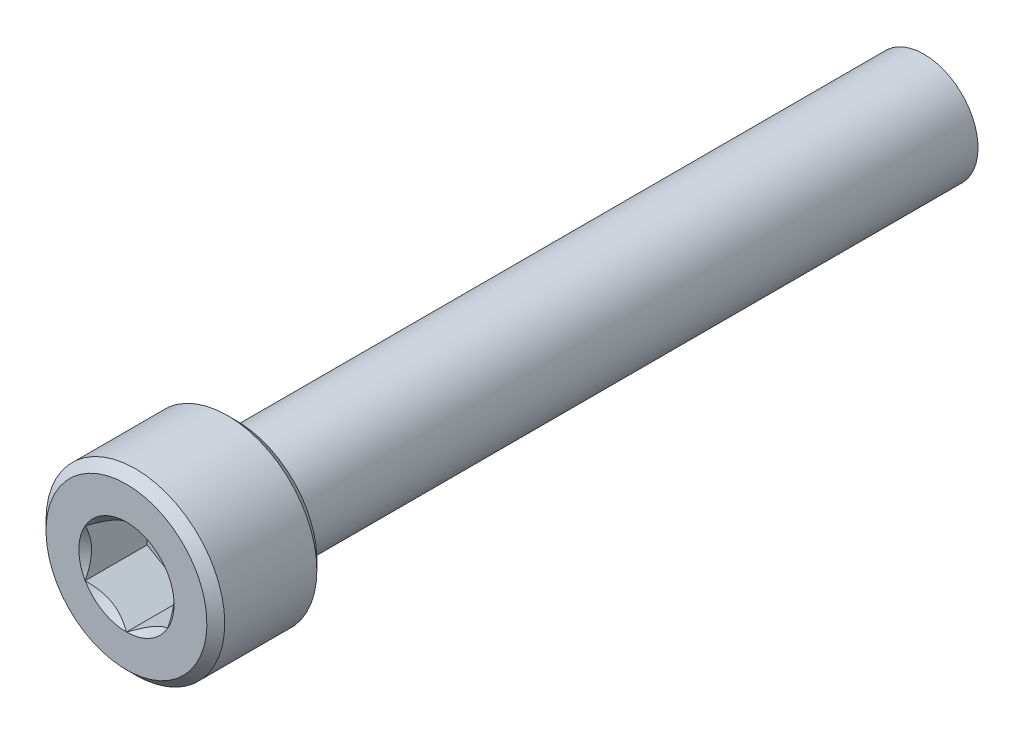
ISO-10303-21;
HEADER;
FILE_DESCRIPTION(('STEP AP214'),'2;1');
FILE_NAME('part.step','',(''),(''),'','','');
FILE_SCHEMA(('AUTOMOTIVE_DESIGN { 1 0 10303 214 1 1 1 1 }'));
ENDSEC;
DATA;
#1=APPLICATION_CONTEXT('core data for automotive mechanical design processes');
#2=APPLICATION_PROTOCOL_DEFINITION('international standard','automotive_design',2000,#1);
#3=PRODUCT_CONTEXT('',#1,'mechanical');
#4=PRODUCT('Part','Part','',(#3));
#5=PRODUCT_RELATED_PRODUCT_CATEGORY('part','',(#4));
#6=PRODUCT_DEFINITION_FORMATION('','',#4);
#7=PRODUCT_DEFINITION_CONTEXT('part definition',#1,'design');
#8=PRODUCT_DEFINITION('design','',#6,#7);
#9=PRODUCT_DEFINITION_SHAPE('','',#8);
#10=(LENGTH_UNIT() NAMED_UNIT(*) SI_UNIT(.MILLI.,.METRE.));
#11=(NAMED_UNIT(*) PLANE_ANGLE_UNIT() SI_UNIT($,.RADIAN.));
#12=(NAMED_UNIT(*) SI_UNIT($,.STERADIAN.) SOLID_ANGLE_UNIT());
#13=UNCERTAINTY_MEASURE_WITH_UNIT(LENGTH_MEASURE(1.E-05),#10,'distance_accuracy_value','');
#14=(GEOMETRIC_REPRESENTATION_CONTEXT(3) GLOBAL_UNCERTAINTY_ASSIGNED_CONTEXT((#13)) GLOBAL_UNIT_ASSIGNED_CONTEXT((#10,
#11,#12)) REPRESENTATION_CONTEXT('',''));
#15=CARTESIAN_POINT('',(0.,0.,0.));
#16=DIRECTION('',(0.,0.,1.));
#17=DIRECTION('',(1.,0.,0.));
#18=AXIS2_PLACEMENT_3D('',#15,#16,#17);
#19=CARTESIAN_POINT('',(3.,-5.19615242270663,3.5));
#20=DIRECTION('',(0.,0.,1.));
#21=DIRECTION('',(0.,-1.,0.));
#22=AXIS2_PLACEMENT_3D('',#19,#20,#21);
#23=PLANE('',#22);
#24=DIRECTION('',(-0.866025403784439,-0.5,0.));
#25=VECTOR('',#24,1.);
#26=CARTESIAN_POINT('',(0.,3.46410161513776,3.5));
#27=LINE('',#26,#25);
#28=CARTESIAN_POINT('',(0.,3.46410161513776,3.5));
#29=VERTEX_POINT('',#28);
#30=CARTESIAN_POINT('',(-3.,1.73205080756888,3.5));
#31=VERTEX_POINT('',#30);
#32=EDGE_CURVE('E82',#29,#31,#27,.T.);
#33=ORIENTED_EDGE('',*,*,#32,.T.);
#34=DIRECTION('',(0.,-1.,0.));
#35=VECTOR('',#34,1.);
#36=CARTESIAN_POINT('',(-3.,1.73205080756888,3.5));
#37=LINE('',#36,#35);
#38=CARTESIAN_POINT('',(-3.,-1.73205080756888,3.5));
#39=VERTEX_POINT('',#38);
#40=EDGE_CURVE('E84',#31,#39,#37,.T.);
#41=ORIENTED_EDGE('',*,*,#40,.T.);
#42=DIRECTION('',(0.866025403784439,-0.5,0.));
#43=VECTOR('',#42,1.);
#44=CARTESIAN_POINT('',(-3.,-1.73205080756888,3.5));
#45=LINE('',#44,#43);
#46=CARTESIAN_POINT('',(0.,-3.46410161513776,3.5));
#47=VERTEX_POINT('',#46);
#48=EDGE_CURVE('E85',#39,#47,#45,.T.);
#49=ORIENTED_EDGE('',*,*,#48,.T.);
#50=DIRECTION('',(0.866025403784439,0.5,0.));
#51=VECTOR('',#50,1.);
#52=CARTESIAN_POINT('',(0.,-3.46410161513776,3.5));
#53=LINE('',#52,#51);
#54=CARTESIAN_POINT('',(3.,-1.73205080756888,3.5));
#55=VERTEX_POINT('',#54);
#56=EDGE_CURVE('E71',#47,#55,#53,.T.);
#57=ORIENTED_EDGE('',*,*,#56,.T.);
#58=DIRECTION('',(0.,1.,0.));
#59=VECTOR('',#58,1.);
#60=CARTESIAN_POINT('',(3.,-1.73205080756888,3.5));
#61=LINE('',#60,#59);
#62=CARTESIAN_POINT('',(3.,1.73205080756888,3.5));
#63=VERTEX_POINT('',#62);
#64=EDGE_CURVE('E110',#55,#63,#61,.T.);
#65=ORIENTED_EDGE('',*,*,#64,.T.);
#66=DIRECTION('',(-0.866025403784439,0.5,0.));
#67=VECTOR('',#66,1.);
#68=CARTESIAN_POINT('',(3.,1.73205080756888,3.5));
#69=LINE('',#68,#67);
#70=EDGE_CURVE('E115',#63,#29,#69,.T.);
#71=ORIENTED_EDGE('',*,*,#70,.T.);
#72=EDGE_LOOP('',(#33,#41,#49,#57,#65,#71));
#73=FACE_BOUND('',#72,.T.);
#74=ADVANCED_FACE('F16',(#73),#23,.T.);
#75=CARTESIAN_POINT('',(-3.,-1.73205080756888,3.5));
#76=DIRECTION('',(-0.5,-0.866025403784439,0.));
#77=DIRECTION('',(0.866025403784439,-0.5,0.));
#78=AXIS2_PLACEMENT_3D('',#75,#76,#77);
#79=PLANE('',#78);
#80=CARTESIAN_POINT('',(-2.99999999999032,-1.7320508075832,8.00000000004136));
#81=CARTESIAN_POINT('',(-2.89688854158698,-1.79158223584331,7.9405256964109));
#82=CARTESIAN_POINT('',(-2.79205304728486,-1.85210903669697,7.88454499927976));
#83=CARTESIAN_POINT('',(-2.57828271602221,-1.97552939499453,7.78204673290586));
#84=CARTESIAN_POINT('',(-2.46932756060096,-2.03843468330721,7.73558617503093));
#85=CARTESIAN_POINT('',(-2.24962485444419,-2.16528009984896,7.65599891925579));
#86=CARTESIAN_POINT('',(-2.13893322488729,-2.2291879419705,7.62267223591901));
#87=CARTESIAN_POINT('',(-1.91511368639457,-2.35841021276905,7.57132616074406));
#88=CARTESIAN_POINT('',(-1.80199261010754,-2.42372069661444,7.55326845527869));
#89=CARTESIAN_POINT('',(-1.60702348021882,-2.53628617623938,7.53697523665388));
#90=CARTESIAN_POINT('',(-1.52542705975241,-2.58339589156056,7.53456399619299));
#91=CARTESIAN_POINT('',(-1.36236704805204,-2.67753863320983,7.53863151806395));
#92=CARTESIAN_POINT('',(-1.28090351339421,-2.72457162687367,7.545113396421));
#93=CARTESIAN_POINT('',(-1.11874833460044,-2.81819196300075,7.56659704587872));
#94=CARTESIAN_POINT('',(-1.03805765621663,-2.86477874788674,7.58160834263353));
#95=CARTESIAN_POINT('',(-0.878062170848356,-2.95715218443323,7.61933151354671));
#96=CARTESIAN_POINT('',(-0.798757258069119,-3.00293889717438,7.64204279713312));
#97=CARTESIAN_POINT('',(-0.657986748130276,-3.08421278898154,7.68876371422157));
#98=CARTESIAN_POINT('',(-0.596209197436678,-3.11988007450436,7.71154386359159));
#99=CARTESIAN_POINT('',(-0.473762853058809,-3.19057450439221,7.76077453974336));
#100=CARTESIAN_POINT('',(-0.413094092865233,-3.22560162942137,7.78722517718446));
#101=CARTESIAN_POINT('',(-0.293056496944738,-3.29490536773894,7.84320408348193));
#102=CARTESIAN_POINT('',(-0.233684247446644,-3.32918395196906,7.87272267287432));
#103=CARTESIAN_POINT('',(-0.116038978212991,-3.39710647983,7.93445005433357));
#104=CARTESIAN_POINT('',(-0.0577653112790005,-3.430750797121,7.96665719768312));
#105=CARTESIAN_POINT('',(-1.43648357031693E-11,-3.46410161512946,8.00000000004499));
#106=B_SPLINE_CURVE_WITH_KNOTS('',3,(#80,#81,#82,#83,#84,#85,#86,#87,#88,#89,#90,#91,#92,#93,
#94,#95,#96,#97,#98,#99,#100,#101,#102,#103,#104,#105),.UNSPECIFIED.,.F.,.F.,(4,2,2,2,2,2,2,2,2,
2,2,2,4),(0.,0.399548839738843,0.801424624392494,1.19691998043515,1.59141997109659,
1.87377108833457,2.15622116274835,2.43898729914404,2.7217317529063,2.94627735487685,
3.17082972801043,3.39469398393905,3.61842195284949),.UNSPECIFIED.);
#107=CARTESIAN_POINT('',(-2.99999999999255,-1.73205080756458,8.00000000004468));
#108=VERTEX_POINT('',#107);
#109=CARTESIAN_POINT('',(5.61843602158199E-12,-3.46410161512591,8.00000000004144));
#110=VERTEX_POINT('',#109);
#111=EDGE_CURVE('E19',#108,#110,#106,.T.);
#112=ORIENTED_EDGE('',*,*,#111,.T.);
#113=DIRECTION('',(0.,0.,1.));
#114=VECTOR('',#113,1.);
#115=CARTESIAN_POINT('',(0.,-3.46410161513776,3.5));
#116=LINE('',#115,#114);
#117=EDGE_CURVE('E90',#110,#47,#116,.F.);
#118=ORIENTED_EDGE('',*,*,#117,.T.);
#119=ORIENTED_EDGE('',*,*,#48,.F.);
#120=DIRECTION('',(0.,0.,1.));
#121=VECTOR('',#120,1.);
#122=CARTESIAN_POINT('',(-3.,-1.73205080756888,3.5));
#123=LINE('',#122,#121);
#124=EDGE_CURVE('E58',#39,#108,#123,.T.);
#125=ORIENTED_EDGE('',*,*,#124,.T.);
#126=EDGE_LOOP('',(#112,#118,#119,#125));
#127=FACE_BOUND('',#126,.T.);
#128=ADVANCED_FACE('F89',(#127),#79,.F.);
#129=CARTESIAN_POINT('',(-3.,1.73205080756888,3.5));
#130=DIRECTION('',(-1.,0.,0.));
#131=DIRECTION('',(0.,-1.,0.));
#132=AXIS2_PLACEMENT_3D('',#129,#130,#131);
#133=PLANE('',#132);
#134=CARTESIAN_POINT('',(-3.00000000000756,1.73205080755334,8.00000000004136));
#135=CARTESIAN_POINT('',(-3.00000000000272,1.61298795102473,7.9405256964109));
#136=CARTESIAN_POINT('',(-3.00000000000073,1.49193434931396,7.88454499927976));
#137=CARTESIAN_POINT('',(-2.99999999999927,1.24509363271631,7.78204673290586));
#138=CARTESIAN_POINT('',(-2.99999999999981,1.11928305609189,7.73558617503093));
#139=CARTESIAN_POINT('',(-3.00000000000019,0.86559222300906,7.65599891925579));
#140=CARTESIAN_POINT('',(-3.00000000000005,0.737776538765718,7.62267223591901));
#141=CARTESIAN_POINT('',(-2.99999999999995,0.479331997168439,7.57132616074405));
#142=CARTESIAN_POINT('',(-2.99999999999999,0.348711029477738,7.55326845527868));
#143=CARTESIAN_POINT('',(-3.00000000000001,0.123580070227885,7.53697523665387));
#144=CARTESIAN_POINT('',(-3.,0.0293606395855113,7.53456399619298));
#145=CARTESIAN_POINT('',(-3.,-0.158924843713037,7.53863151806394));
#146=CARTESIAN_POINT('',(-3.,-0.252990831040703,7.54511339642099));
#147=CARTESIAN_POINT('',(-3.,-0.440231503294856,7.56659704587872));
#148=CARTESIAN_POINT('',(-3.,-0.533405073066836,7.58160834263352));
#149=CARTESIAN_POINT('',(-3.,-0.718151946159826,7.61933151354671));
#150=CARTESIAN_POINT('',(-3.,-0.809725371642131,7.64204279713312));
#151=CARTESIAN_POINT('',(-3.,-0.972273155256436,7.68876371422157));
#152=CARTESIAN_POINT('',(-3.,-1.04360772630208,7.71154386359159));
#153=CARTESIAN_POINT('',(-3.,-1.18499658607778,7.76077453974336));
#154=CARTESIAN_POINT('',(-3.,-1.25505083613611,7.78722517718446));
#155=CARTESIAN_POINT('',(-3.,-1.39365831277125,7.84320408348193));
#156=CARTESIAN_POINT('',(-3.,-1.46221548123149,7.87272267287432));
#157=CARTESIAN_POINT('',(-3.,-1.59806053695336,7.93445005433357));
#158=CARTESIAN_POINT('',(-3.,-1.66534917153537,7.96665719768312));
#159=CARTESIAN_POINT('',(-3.,-1.73205080755229,8.00000000004499));
#160=B_SPLINE_CURVE_WITH_KNOTS('',3,(#134,#135,#136,#137,#138,#139,#140,#141,#142,#143,#144,
#145,#146,#147,#148,#149,#150,#151,#152,#153,#154,#155,#156,#157,#158,#159),.UNSPECIFIED.,.F.,
.F.,(4,2,2,2,2,2,2,2,2,2,2,2,4),(0.,0.399548839738845,0.801424624392497,1.19691998043516,
1.59141997109659,1.87377108833457,2.15622116274836,2.43898729914404,2.7217317529063,
2.94627735487685,3.17082972801044,3.39469398393906,3.6184219528495),.UNSPECIFIED.);
#161=CARTESIAN_POINT('',(-2.99999999999255,1.73205080756458,8.00000000004468));
#162=VERTEX_POINT('',#161);
#163=EDGE_CURVE('E94',#162,#108,#160,.T.);
#164=ORIENTED_EDGE('',*,*,#163,.T.);
#165=ORIENTED_EDGE('',*,*,#124,.F.);
#166=ORIENTED_EDGE('',*,*,#40,.F.);
#167=DIRECTION('',(0.,0.,1.));
#168=VECTOR('',#167,1.);
#169=CARTESIAN_POINT('',(-3.,1.73205080756888,3.5));
#170=LINE('',#169,#168);
#171=EDGE_CURVE('E96',#31,#162,#170,.T.);
#172=ORIENTED_EDGE('',*,*,#171,.T.);
#173=EDGE_LOOP('',(#164,#165,#166,#172));
#174=FACE_BOUND('',#173,.T.);
#175=ADVANCED_FACE('F92',(#174),#133,.F.);
#176=CARTESIAN_POINT('',(0.,3.46410161513776,3.5));
#177=DIRECTION('',(-0.5,0.866025403784439,0.));
#178=DIRECTION('',(-0.866025403784439,-0.5,0.));
#179=AXIS2_PLACEMENT_3D('',#176,#177,#178);
#180=PLANE('',#179);
#181=CARTESIAN_POINT('',(-1.72454109732172E-11,3.46410161513654,8.00000000004137));
#182=CARTESIAN_POINT('',(-0.103111458415738,3.40457018686804,7.9405256964109));
#183=CARTESIAN_POINT('',(-0.207946952715874,3.34404338601093,7.88454499927977));
#184=CARTESIAN_POINT('',(-0.42171728397706,3.22062302771084,7.78204673290587));
#185=CARTESIAN_POINT('',(-0.53067243939885,3.15771773939909,7.73558617503093));
#186=CARTESIAN_POINT('',(-0.750375145556008,3.03087232285802,7.6559989192558));
#187=CARTESIAN_POINT('',(-0.861066775112762,2.96696448073622,7.62267223591901));
#188=CARTESIAN_POINT('',(-1.08488631360538,2.8377422099375,7.57132616074406));
#189=CARTESIAN_POINT('',(-1.19800738989245,2.77243172609218,7.55326845527869));
#190=CARTESIAN_POINT('',(-1.39297651978119,2.65986624646727,7.53697523665388));
#191=CARTESIAN_POINT('',(-1.47457294024759,2.61275653114608,7.53456399619299));
#192=CARTESIAN_POINT('',(-1.63763295194796,2.5186137894968,7.53863151806395));
#193=CARTESIAN_POINT('',(-1.71909648660579,2.47158079583297,7.545113396421));
#194=CARTESIAN_POINT('',(-1.88125166539956,2.37796045970589,7.56659704587872));
#195=CARTESIAN_POINT('',(-1.96194234378338,2.3313736748199,7.58160834263353));
#196=CARTESIAN_POINT('',(-2.12193782915165,2.23900023827341,7.61933151354671));
#197=CARTESIAN_POINT('',(-2.20124274193088,2.19321352553226,7.64204279713312));
#198=CARTESIAN_POINT('',(-2.34201325186973,2.1119396337251,7.68876371422157));
#199=CARTESIAN_POINT('',(-2.40379080256332,2.07627234820228,7.7115438635916));
#200=CARTESIAN_POINT('',(-2.52623714694119,2.00557791831443,7.76077453974336));
#201=CARTESIAN_POINT('',(-2.58690590713477,1.97055079328527,7.78722517718446));
#202=CARTESIAN_POINT('',(-2.70694350305526,1.9012470549677,7.84320408348194));
#203=CARTESIAN_POINT('',(-2.76631575255336,1.86696847073758,7.87272267287432));
#204=CARTESIAN_POINT('',(-2.88396102178701,1.79904594287664,7.93445005433357));
#205=CARTESIAN_POINT('',(-2.942234688721,1.76540162558564,7.96665719768312));
#206=CARTESIAN_POINT('',(-2.99999999998564,1.73205080757718,8.00000000004499));
#207=B_SPLINE_CURVE_WITH_KNOTS('',3,(#181,#182,#183,#184,#185,#186,#187,#188,#189,#190,#191,
#192,#193,#194,#195,#196,#197,#198,#199,#200,#201,#202,#203,#204,#205,#206),.UNSPECIFIED.,.F.,
.F.,(4,2,2,2,2,2,2,2,2,2,2,2,4),(0.,0.399548839738842,0.801424624392494,1.19691998043515,
1.59141997109659,1.87377108833457,2.15622116274835,2.43898729914404,2.7217317529063,
2.94627735487685,3.17082972801043,3.39469398393906,3.61842195284949),.UNSPECIFIED.);
#208=CARTESIAN_POINT('',(0.,3.46410161512916,8.00000000004468));
#209=VERTEX_POINT('',#208);
#210=EDGE_CURVE('E197',#209,#162,#207,.T.);
#211=ORIENTED_EDGE('',*,*,#210,.T.);
#212=ORIENTED_EDGE('',*,*,#171,.F.);
#213=ORIENTED_EDGE('',*,*,#32,.F.);
#214=DIRECTION('',(0.,0.,1.));
#215=VECTOR('',#214,1.);
#216=CARTESIAN_POINT('',(0.,3.46410161513776,3.5));
#217=LINE('',#216,#215);
#218=EDGE_CURVE('E112',#29,#209,#217,.T.);
#219=ORIENTED_EDGE('',*,*,#218,.T.);
#220=EDGE_LOOP('',(#211,#212,#213,#219));
#221=FACE_BOUND('',#220,.T.);
#222=ADVANCED_FACE('F207',(#221),#180,.F.);
#223=CARTESIAN_POINT('',(3.,1.73205080756888,3.5));
#224=DIRECTION('',(0.5,0.866025403784439,0.));
#225=DIRECTION('',(-0.866025403784439,0.5,0.));
#226=AXIS2_PLACEMENT_3D('',#223,#224,#225);
#227=PLANE('',#226);
#228=CARTESIAN_POINT('',(2.99999999999032,1.7320508075832,8.00000000004136));
#229=CARTESIAN_POINT('',(2.89688854158699,1.79158223584331,7.9405256964109));
#230=CARTESIAN_POINT('',(2.79205304728486,1.85210903669697,7.88454499927976));
#231=CARTESIAN_POINT('',(2.57828271602221,1.97552939499453,7.78204673290586));
#232=CARTESIAN_POINT('',(2.46932756060096,2.03843468330721,7.73558617503093));
#233=CARTESIAN_POINT('',(2.24962485444419,2.16528009984896,7.65599891925579));
#234=CARTESIAN_POINT('',(2.13893322488729,2.2291879419705,7.62267223591901));
#235=CARTESIAN_POINT('',(1.91511368639457,2.35841021276906,7.57132616074406));
#236=CARTESIAN_POINT('',(1.80199261010754,2.42372069661444,7.55326845527869));
#237=CARTESIAN_POINT('',(1.60702348021882,2.53628617623938,7.53697523665388));
#238=CARTESIAN_POINT('',(1.52542705975241,2.58339589156056,7.53456399619299));
#239=CARTESIAN_POINT('',(1.36236704805204,2.67753863320983,7.53863151806395));
#240=CARTESIAN_POINT('',(1.28090351339422,2.72457162687367,7.545113396421));
#241=CARTESIAN_POINT('',(1.11874833460044,2.81819196300075,7.56659704587872));
#242=CARTESIAN_POINT('',(1.03805765621663,2.86477874788674,7.58160834263352));
#243=CARTESIAN_POINT('',(0.878062170848357,2.95715218443323,7.61933151354671));
#244=CARTESIAN_POINT('',(0.79875725806912,3.00293889717438,7.64204279713312));
#245=CARTESIAN_POINT('',(0.657986748130277,3.08421278898154,7.68876371422157));
#246=CARTESIAN_POINT('',(0.596209197436679,3.11988007450436,7.71154386359159));
#247=CARTESIAN_POINT('',(0.47376285305881,3.19057450439221,7.76077453974336));
#248=CARTESIAN_POINT('',(0.413094092865233,3.22560162942137,7.78722517718446));
#249=CARTESIAN_POINT('',(0.293056496944738,3.29490536773894,7.84320408348193));
#250=CARTESIAN_POINT('',(0.233684247446644,3.32918395196906,7.87272267287432));
#251=CARTESIAN_POINT('',(0.116038978212991,3.39710647983,7.93445005433357));
#252=CARTESIAN_POINT('',(0.0577653112790009,3.430750797121,7.96665719768312));
#253=CARTESIAN_POINT('',(1.43651801139567E-11,3.46410161512946,8.00000000004499));
#254=B_SPLINE_CURVE_WITH_KNOTS('',3,(#228,#229,#230,#231,#232,#233,#234,#235,#236,#237,#238,
#239,#240,#241,#242,#243,#244,#245,#246,#247,#248,#249,#250,#251,#252,#253),.UNSPECIFIED.,.F.,
.F.,(4,2,2,2,2,2,2,2,2,2,2,2,4),(0.,0.399548839738842,0.801424624392494,1.19691998043515,
1.59141997109659,1.87377108833457,2.15622116274835,2.43898729914404,2.7217317529063,
2.94627735487685,3.17082972801043,3.39469398393906,3.61842195284949),.UNSPECIFIED.);
#255=CARTESIAN_POINT('',(2.99999999999255,1.73205080756458,8.00000000004468));
#256=VERTEX_POINT('',#255);
#257=EDGE_CURVE('E189',#256,#209,#254,.T.);
#258=ORIENTED_EDGE('',*,*,#257,.T.);
#259=ORIENTED_EDGE('',*,*,#218,.F.);
#260=ORIENTED_EDGE('',*,*,#70,.F.);
#261=DIRECTION('',(0.,0.,-1.));
#262=VECTOR('',#261,1.);
#263=CARTESIAN_POINT('',(3.,1.73205080756888,3.5));
#264=LINE('',#263,#262);
#265=EDGE_CURVE('E107',#63,#256,#264,.F.);
#266=ORIENTED_EDGE('',*,*,#265,.T.);
#267=EDGE_LOOP('',(#258,#259,#260,#266));
#268=FACE_BOUND('',#267,.T.);
#269=ADVANCED_FACE('F203',(#268),#227,.F.);
#270=CARTESIAN_POINT('',(3.,-1.73205080756888,3.5));
#271=DIRECTION('',(1.,0.,0.));
#272=DIRECTION('',(0.,0.,-1.));
#273=AXIS2_PLACEMENT_3D('',#270,#271,#272);
#274=PLANE('',#273);
#275=CARTESIAN_POINT('',(3.00000000000756,-1.73205080755334,8.00000000004136));
#276=CARTESIAN_POINT('',(3.00000000000272,-1.61298795102473,7.9405256964109));
#277=CARTESIAN_POINT('',(3.00000000000073,-1.49193434931396,7.88454499927976));
#278=CARTESIAN_POINT('',(2.99999999999927,-1.24509363271631,7.78204673290586));
#279=CARTESIAN_POINT('',(2.99999999999981,-1.11928305609189,7.73558617503093));
#280=CARTESIAN_POINT('',(3.00000000000019,-0.86559222300906,7.65599891925579));
#281=CARTESIAN_POINT('',(3.00000000000005,-0.737776538765717,7.62267223591901));
#282=CARTESIAN_POINT('',(2.99999999999995,-0.479331997168439,7.57132616074405));
#283=CARTESIAN_POINT('',(2.99999999999999,-0.348711029477738,7.55326845527868));
#284=CARTESIAN_POINT('',(3.00000000000001,-0.123580070227885,7.53697523665387));
#285=CARTESIAN_POINT('',(3.,-0.0293606395855116,7.53456399619299));
#286=CARTESIAN_POINT('',(3.,0.158924843713037,7.53863151806395));
#287=CARTESIAN_POINT('',(3.,0.252990831040703,7.54511339642099));
#288=CARTESIAN_POINT('',(3.,0.440231503294856,7.56659704587872));
#289=CARTESIAN_POINT('',(3.,0.533405073066836,7.58160834263352));
#290=CARTESIAN_POINT('',(3.,0.718151946159826,7.61933151354671));
#291=CARTESIAN_POINT('',(3.,0.80972537164213,7.64204279713312));
#292=CARTESIAN_POINT('',(3.,0.972273155256435,7.68876371422157));
#293=CARTESIAN_POINT('',(3.,1.04360772630208,7.71154386359159));
#294=CARTESIAN_POINT('',(3.,1.18499658607778,7.76077453974336));
#295=CARTESIAN_POINT('',(3.,1.25505083613611,7.78722517718446));
#296=CARTESIAN_POINT('',(3.,1.39365831277125,7.84320408348193));
#297=CARTESIAN_POINT('',(3.,1.46221548123149,7.87272267287432));
#298=CARTESIAN_POINT('',(3.,1.59806053695336,7.93445005433357));
#299=CARTESIAN_POINT('',(3.,1.66534917153537,7.96665719768312));
#300=CARTESIAN_POINT('',(3.,1.73205080755229,8.00000000004499));
#301=B_SPLINE_CURVE_WITH_KNOTS('',3,(#275,#276,#277,#278,#279,#280,#281,#282,#283,#284,#285,
#286,#287,#288,#289,#290,#291,#292,#293,#294,#295,#296,#297,#298,#299,#300),.UNSPECIFIED.,.F.,
.F.,(4,2,2,2,2,2,2,2,2,2,2,2,4),(0.,0.399548839738844,0.801424624392497,1.19691998043516,
1.59141997109659,1.87377108833457,2.15622116274836,2.43898729914404,2.7217317529063,
2.94627735487685,3.17082972801044,3.39469398393906,3.6184219528495),.UNSPECIFIED.);
#302=CARTESIAN_POINT('',(2.99999999999255,-1.73205080756458,8.00000000004468));
#303=VERTEX_POINT('',#302);
#304=EDGE_CURVE('E159',#303,#256,#301,.T.);
#305=ORIENTED_EDGE('',*,*,#304,.T.);
#306=ORIENTED_EDGE('',*,*,#265,.F.);
#307=ORIENTED_EDGE('',*,*,#64,.F.);
#308=DIRECTION('',(0.,0.,1.));
#309=VECTOR('',#308,1.);
#310=CARTESIAN_POINT('',(3.,-1.73205080756888,3.5));
#311=LINE('',#310,#309);
#312=EDGE_CURVE('E39',#55,#303,#311,.T.);
#313=ORIENTED_EDGE('',*,*,#312,.T.);
#314=EDGE_LOOP('',(#305,#306,#307,#313));
#315=FACE_BOUND('',#314,.T.);
#316=ADVANCED_FACE('F206',(#315),#274,.F.);
#317=CARTESIAN_POINT('',(0.,-3.46410161513776,3.5));
#318=DIRECTION('',(0.5,-0.866025403784439,0.));
#319=DIRECTION('',(0.866025403784439,0.5,0.));
#320=AXIS2_PLACEMENT_3D('',#317,#318,#319);
#321=PLANE('',#320);
#322=CARTESIAN_POINT('',(1.72473274328695E-11,-3.46410161513653,8.00000000004137));
#323=CARTESIAN_POINT('',(0.10311145841574,-3.40457018686804,7.9405256964109));
#324=CARTESIAN_POINT('',(0.207946952715876,-3.34404338601093,7.88454499927977));
#325=CARTESIAN_POINT('',(0.421717283977062,-3.22062302771084,7.78204673290587));
#326=CARTESIAN_POINT('',(0.530672439398852,-3.15771773939909,7.73558617503094));
#327=CARTESIAN_POINT('',(0.75037514555601,-3.03087232285802,7.6559989192558));
#328=CARTESIAN_POINT('',(0.861066775112763,-2.96696448073622,7.62267223591901));
#329=CARTESIAN_POINT('',(1.08488631360538,-2.8377422099375,7.57132616074406));
#330=CARTESIAN_POINT('',(1.19800738989245,-2.77243172609218,7.55326845527869));
#331=CARTESIAN_POINT('',(1.39297651978119,-2.65986624646727,7.53697523665388));
#332=CARTESIAN_POINT('',(1.47457294024759,-2.61275653114608,7.53456399619299));
#333=CARTESIAN_POINT('',(1.63763295194796,-2.5186137894968,7.53863151806395));
#334=CARTESIAN_POINT('',(1.71909648660579,-2.47158079583297,7.545113396421));
#335=CARTESIAN_POINT('',(1.88125166539956,-2.37796045970589,7.56659704587873));
#336=CARTESIAN_POINT('',(1.96194234378338,-2.3313736748199,7.58160834263353));
#337=CARTESIAN_POINT('',(2.12193782915165,-2.23900023827341,7.61933151354671));
#338=CARTESIAN_POINT('',(2.20124274193088,-2.19321352553225,7.64204279713312));
#339=CARTESIAN_POINT('',(2.34201325186973,-2.1119396337251,7.68876371422157));
#340=CARTESIAN_POINT('',(2.40379080256333,-2.07627234820228,7.7115438635916));
#341=CARTESIAN_POINT('',(2.52623714694119,-2.00557791831443,7.76077453974336));
#342=CARTESIAN_POINT('',(2.58690590713477,-1.97055079328527,7.78722517718447));
#343=CARTESIAN_POINT('',(2.70694350305526,-1.9012470549677,7.84320408348194));
#344=CARTESIAN_POINT('',(2.76631575255336,-1.86696847073758,7.87272267287432));
#345=CARTESIAN_POINT('',(2.88396102178701,-1.79904594287664,7.93445005433357));
#346=CARTESIAN_POINT('',(2.942234688721,-1.76540162558564,7.96665719768313));
#347=CARTESIAN_POINT('',(2.99999999998563,-1.73205080757718,8.00000000004499));
#348=B_SPLINE_CURVE_WITH_KNOTS('',3,(#322,#323,#324,#325,#326,#327,#328,#329,#330,#331,#332,
#333,#334,#335,#336,#337,#338,#339,#340,#341,#342,#343,#344,#345,#346,#347),.UNSPECIFIED.,.F.,
.F.,(4,2,2,2,2,2,2,2,2,2,2,2,4),(0.,0.399548839738842,0.801424624392493,1.19691998043515,
1.59141997109658,1.87377108833456,2.15622116274835,2.43898729914404,2.7217317529063,
2.94627735487685,3.17082972801043,3.39469398393905,3.61842195284948),.UNSPECIFIED.);
#349=EDGE_CURVE('E151',#110,#303,#348,.T.);
#350=ORIENTED_EDGE('',*,*,#349,.T.);
#351=ORIENTED_EDGE('',*,*,#312,.F.);
#352=ORIENTED_EDGE('',*,*,#56,.F.);
#353=ORIENTED_EDGE('',*,*,#117,.F.);
#354=EDGE_LOOP('',(#350,#351,#352,#353));
#355=FACE_BOUND('',#354,.T.);
#356=ADVANCED_FACE('F167',(#355),#321,.F.);
#357=CARTESIAN_POINT('',(0.,0.,7.99999999998136));
#358=DIRECTION('',(0.,0.,1.));
#359=DIRECTION('',(1.,0.,0.));
#360=AXIS2_PLACEMENT_3D('',#357,#358,#359);
#361=CONICAL_SURFACE('',#360,3.46410161506583,0.785398163397448);
#362=ORIENTED_EDGE('',*,*,#111,.F.);
#363=CARTESIAN_POINT('',(0.,0.,8.0000000000382));
#364=DIRECTION('',(0.,0.,1.));
#365=DIRECTION('',(1.,0.,0.));
#366=AXIS2_PLACEMENT_3D('',#363,#364,#365);
#367=CIRCLE('',#366,3.46410161512267);
#368=EDGE_CURVE('E148',#110,#108,#367,.F.);
#369=ORIENTED_EDGE('',*,*,#368,.F.);
#370=EDGE_LOOP('',(#362,#369));
#371=FACE_BOUND('',#370,.T.);
#372=ADVANCED_FACE('F224',(#371),#361,.F.);
#373=CARTESIAN_POINT('',(0.,0.,7.99999999998136));
#374=DIRECTION('',(0.,0.,1.));
#375=DIRECTION('',(1.,0.,0.));
#376=AXIS2_PLACEMENT_3D('',#373,#374,#375);
#377=CONICAL_SURFACE('',#376,3.46410161506583,0.785398163397448);
#378=CARTESIAN_POINT('',(0.,0.,8.0000000000382));
#379=DIRECTION('',(0.,0.,1.));
#380=DIRECTION('',(1.,0.,0.));
#381=AXIS2_PLACEMENT_3D('',#378,#379,#380);
#382=CIRCLE('',#381,3.46410161512267);
#383=EDGE_CURVE('E145',#108,#162,#382,.F.);
#384=ORIENTED_EDGE('',*,*,#383,.F.);
#385=ORIENTED_EDGE('',*,*,#163,.F.);
#386=EDGE_LOOP('',(#384,#385));
#387=FACE_BOUND('',#386,.T.);
#388=ADVANCED_FACE('F221',(#387),#377,.F.);
#389=CARTESIAN_POINT('',(0.,0.,7.99999999998136));
#390=DIRECTION('',(0.,0.,1.));
#391=DIRECTION('',(1.,0.,0.));
#392=AXIS2_PLACEMENT_3D('',#389,#390,#391);
#393=CONICAL_SURFACE('',#392,3.46410161506583,0.785398163397448);
#394=ORIENTED_EDGE('',*,*,#210,.F.);
#395=CARTESIAN_POINT('',(0.,0.,8.0000000000382));
#396=DIRECTION('',(0.,0.,1.));
#397=DIRECTION('',(1.,0.,0.));
#398=AXIS2_PLACEMENT_3D('',#395,#396,#397);
#399=CIRCLE('',#398,3.46410161512267);
#400=EDGE_CURVE('E142',#162,#209,#399,.F.);
#401=ORIENTED_EDGE('',*,*,#400,.F.);
#402=EDGE_LOOP('',(#394,#401));
#403=FACE_BOUND('',#402,.T.);
#404=ADVANCED_FACE('F185',(#403),#393,.F.);
#405=CARTESIAN_POINT('',(0.,0.,7.99999999998136));
#406=DIRECTION('',(0.,0.,1.));
#407=DIRECTION('',(1.,0.,0.));
#408=AXIS2_PLACEMENT_3D('',#405,#406,#407);
#409=CONICAL_SURFACE('',#408,3.46410161506583,0.785398163397448);
#410=ORIENTED_EDGE('',*,*,#257,.F.);
#411=CARTESIAN_POINT('',(0.,0.,8.0000000000382));
#412=DIRECTION('',(0.,0.,1.));
#413=DIRECTION('',(1.,0.,0.));
#414=AXIS2_PLACEMENT_3D('',#411,#412,#413);
#415=CIRCLE('',#414,3.46410161512267);
#416=EDGE_CURVE('E139',#209,#256,#415,.F.);
#417=ORIENTED_EDGE('',*,*,#416,.F.);
#418=EDGE_LOOP('',(#410,#417));
#419=FACE_BOUND('',#418,.T.);
#420=ADVANCED_FACE('F180',(#419),#409,.F.);
#421=CARTESIAN_POINT('',(0.,0.,7.99999999998136));
#422=DIRECTION('',(0.,0.,1.));
#423=DIRECTION('',(1.,0.,0.));
#424=AXIS2_PLACEMENT_3D('',#421,#422,#423);
#425=CONICAL_SURFACE('',#424,3.46410161506583,0.785398163397448);
#426=ORIENTED_EDGE('',*,*,#304,.F.);
#427=CARTESIAN_POINT('',(0.,0.,8.0000000000382));
#428=DIRECTION('',(0.,0.,1.));
#429=DIRECTION('',(1.,0.,0.));
#430=AXIS2_PLACEMENT_3D('',#427,#428,#429);
#431=CIRCLE('',#430,3.46410161512267);
#432=EDGE_CURVE('E136',#256,#303,#431,.F.);
#433=ORIENTED_EDGE('',*,*,#432,.F.);
#434=EDGE_LOOP('',(#426,#433));
#435=FACE_BOUND('',#434,.T.);
#436=ADVANCED_FACE('F174',(#435),#425,.F.);
#437=CARTESIAN_POINT('',(0.,0.,7.99999999998136));
#438=DIRECTION('',(0.,0.,1.));
#439=DIRECTION('',(1.,0.,0.));
#440=AXIS2_PLACEMENT_3D('',#437,#438,#439);
#441=CONICAL_SURFACE('',#440,3.46410161506583,0.785398163397448);
#442=ORIENTED_EDGE('',*,*,#349,.F.);
#443=CARTESIAN_POINT('',(0.,0.,8.0000000000382));
#444=DIRECTION('',(0.,0.,1.));
#445=DIRECTION('',(1.,0.,0.));
#446=AXIS2_PLACEMENT_3D('',#443,#444,#445);
#447=CIRCLE('',#446,3.46410161512267);
#448=EDGE_CURVE('E133',#303,#110,#447,.F.);
#449=ORIENTED_EDGE('',*,*,#448,.F.);
#450=EDGE_LOOP('',(#442,#449));
#451=FACE_BOUND('',#450,.T.);
#452=ADVANCED_FACE('F169',(#451),#441,.F.);
#453=CARTESIAN_POINT('',(0.,0.,8.));
#454=DIRECTION('',(0.,0.,1.));
#455=DIRECTION('',(0.,-1.,0.));
#456=AXIS2_PLACEMENT_3D('',#453,#454,#455);
#457=PLANE('',#456);
#458=ORIENTED_EDGE('',*,*,#432,.T.);
#459=ORIENTED_EDGE('',*,*,#448,.T.);
#460=ORIENTED_EDGE('',*,*,#368,.T.);
#461=ORIENTED_EDGE('',*,*,#383,.T.);
#462=ORIENTED_EDGE('',*,*,#400,.T.);
#463=ORIENTED_EDGE('',*,*,#416,.T.);
#464=EDGE_LOOP('',(#458,#459,#460,#461,#462,#463));
#465=FACE_BOUND('',#464,.T.);
#466=CARTESIAN_POINT('',(0.,0.,7.99999999998136));
#467=DIRECTION('',(0.,0.,-1.));
#468=DIRECTION('',(0.,1.,0.));
#469=AXIS2_PLACEMENT_3D('',#466,#467,#468);
#470=CIRCLE('',#469,5.8500000000663);
#471=CARTESIAN_POINT('',(0.,5.8500000000663,7.99999999998136));
#472=VERTEX_POINT('',#471);
#473=EDGE_CURVE('E129',#472,#472,#470,.T.);
#474=ORIENTED_EDGE('',*,*,#473,.F.);
#475=EDGE_LOOP('',(#474));
#476=FACE_BOUND('',#475,.T.);
#477=ADVANCED_FACE('F173',(#465,#476),#457,.T.);
#478=CARTESIAN_POINT('',(0.,0.,7.35000000003083));
#479=DIRECTION('',(0.,0.,-1.));
#480=DIRECTION('',(0.,1.,0.));
#481=AXIS2_PLACEMENT_3D('',#478,#479,#480);
#482=CONICAL_SURFACE('',#481,6.50000000001683,0.785398163397448);
#483=ORIENTED_EDGE('',*,*,#473,.T.);
#484=EDGE_LOOP('',(#483));
#485=FACE_BOUND('',#484,.T.);
#486=CARTESIAN_POINT('',(0.,0.,7.34999999999999));
#487=DIRECTION('',(0.,0.,-1.));
#488=DIRECTION('',(0.,1.,0.));
#489=AXIS2_PLACEMENT_3D('',#486,#487,#488);
#490=CIRCLE('',#489,6.5);
#491=CARTESIAN_POINT('',(0.,6.5,7.34999999999999));
#492=VERTEX_POINT('',#491);
#493=EDGE_CURVE('E132',#492,#492,#490,.T.);
#494=ORIENTED_EDGE('',*,*,#493,.F.);
#495=EDGE_LOOP('',(#494));
#496=FACE_BOUND('',#495,.T.);
#497=ADVANCED_FACE('F256',(#485,#496),#482,.T.);
#498=CARTESIAN_POINT('',(0.,0.,8.));
#499=DIRECTION('',(0.,0.,-1.));
#500=DIRECTION('',(0.,1.,0.));
#501=AXIS2_PLACEMENT_3D('',#498,#499,#500);
#502=CYLINDRICAL_SURFACE('',#501,6.5);
#503=ORIENTED_EDGE('',*,*,#493,.T.);
#504=EDGE_LOOP('',(#503));
#505=FACE_BOUND('',#504,.T.);
#506=CARTESIAN_POINT('',(0.,0.,0.650000000007367));
#507=DIRECTION('',(0.,0.,1.));
#508=DIRECTION('',(-1.,0.,0.));
#509=AXIS2_PLACEMENT_3D('',#506,#507,#508);
#510=CIRCLE('',#509,6.50000000001683);
#511=CARTESIAN_POINT('',(-6.50000000001682,0.,0.650000000007367));
#512=VERTEX_POINT('',#511);
#513=EDGE_CURVE('E128',#512,#512,#510,.F.);
#514=ORIENTED_EDGE('',*,*,#513,.F.);
#515=EDGE_LOOP('',(#514));
#516=FACE_BOUND('',#515,.T.);
#517=ADVANCED_FACE('F253',(#505,#516),#502,.T.);
#518=CARTESIAN_POINT('',(0.,0.,0.650000000007367));
#519=DIRECTION('',(0.,0.,1.));
#520=DIRECTION('',(0.,-1.,0.));
#521=AXIS2_PLACEMENT_3D('',#518,#519,#520);
#522=CONICAL_SURFACE('',#521,6.50000000001683,0.785398163397448);
#523=CARTESIAN_POINT('',(0.,0.,5.6843418860808E-11));
#524=DIRECTION('',(0.,0.,1.));
#525=DIRECTION('',(0.,-1.,0.));
#526=AXIS2_PLACEMENT_3D('',#523,#524,#525);
#527=CIRCLE('',#526,5.8500000000663);
#528=CARTESIAN_POINT('',(0.,-5.8500000000663,5.68441506972745E-11));
#529=VERTEX_POINT('',#528);
#530=EDGE_CURVE('E125',#529,#529,#527,.T.);
#531=ORIENTED_EDGE('',*,*,#530,.T.);
#532=EDGE_LOOP('',(#531));
#533=FACE_BOUND('',#532,.T.);
#534=ORIENTED_EDGE('',*,*,#513,.T.);
#535=EDGE_LOOP('',(#534));
#536=FACE_BOUND('',#535,.T.);
#537=ADVANCED_FACE('F249',(#533,#536),#522,.T.);
#538=CARTESIAN_POINT('',(0.,0.,-50.));
#539=DIRECTION('',(0.,0.,-1.));
#540=DIRECTION('',(0.,1.,0.));
#541=AXIS2_PLACEMENT_3D('',#538,#539,#540);
#542=PLANE('',#541);
#543=CARTESIAN_POINT('',(0.,0.,-50.));
#544=DIRECTION('',(0.,0.,-1.));
#545=DIRECTION('',(0.,1.,0.));
#546=AXIS2_PLACEMENT_3D('',#543,#544,#545);
#547=CIRCLE('',#546,3.933);
#548=CARTESIAN_POINT('',(0.,3.93299999999999,-50.));
#549=VERTEX_POINT('',#548);
#550=EDGE_CURVE('E30',#549,#549,#547,.F.);
#551=ORIENTED_EDGE('',*,*,#550,.F.);
#552=EDGE_LOOP('',(#551));
#553=FACE_BOUND('',#552,.T.);
#554=ADVANCED_FACE('F242',(#553),#542,.T.);
#555=CARTESIAN_POINT('',(0.,0.,0.));
#556=DIRECTION('',(0.,0.,1.));
#557=DIRECTION('',(0.,-1.,0.));
#558=AXIS2_PLACEMENT_3D('',#555,#556,#557);
#559=PLANE('',#558);
#560=CARTESIAN_POINT('',(0.,0.,0.));
#561=DIRECTION('',(0.,0.,-1.));
#562=DIRECTION('',(0.,1.,0.));
#563=AXIS2_PLACEMENT_3D('',#560,#561,#562);
#564=CIRCLE('',#563,3.933);
#565=CARTESIAN_POINT('',(0.,3.933,0.));
#566=VERTEX_POINT('',#565);
#567=EDGE_CURVE('E11',#566,#566,#564,.T.);
#568=ORIENTED_EDGE('',*,*,#567,.F.);
#569=EDGE_LOOP('',(#568));
#570=FACE_BOUND('',#569,.T.);
#571=ORIENTED_EDGE('',*,*,#530,.F.);
#572=EDGE_LOOP('',(#571));
#573=FACE_BOUND('',#572,.T.);
#574=ADVANCED_FACE('F236',(#570,#573),#559,.F.);
#575=CARTESIAN_POINT('',(0.,0.,0.));
#576=DIRECTION('',(0.,0.,-1.));
#577=DIRECTION('',(0.,1.,0.));
#578=AXIS2_PLACEMENT_3D('',#575,#576,#577);
#579=CYLINDRICAL_SURFACE('',#578,3.933);
#580=ORIENTED_EDGE('',*,*,#567,.T.);
#581=EDGE_LOOP('',(#580));
#582=FACE_BOUND('',#581,.T.);
#583=ORIENTED_EDGE('',*,*,#550,.T.);
#584=EDGE_LOOP('',(#583));
#585=FACE_BOUND('',#584,.T.);
#586=ADVANCED_FACE('F234',(#582,#585),#579,.T.);
#587=CLOSED_SHELL('',(#74,#128,#175,#222,#269,#316,#356,#372,#388,#404,#420,#436,#452,#477,#497,
#517,#537,#554,#574,#586));
#588=MANIFOLD_SOLID_BREP('B1',#587);
#589=ADVANCED_BREP_SHAPE_REPRESENTATION('',(#18,#588),#14);
#590=SHAPE_DEFINITION_REPRESENTATION(#9,#589);
ENDSEC;
END-ISO-10303-21;
